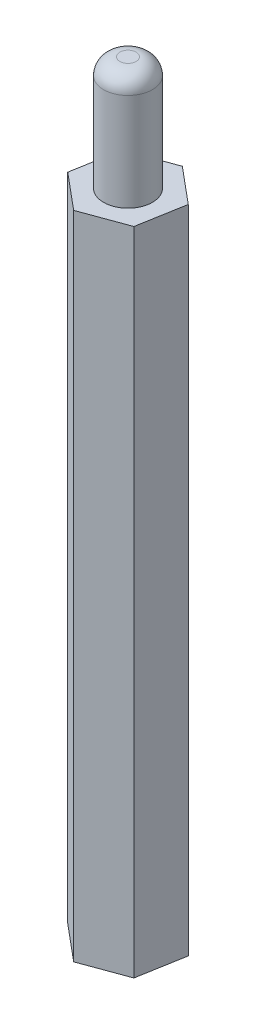
ISO-10303-21;
HEADER;
FILE_DESCRIPTION(('STEP AP214'),'2;1');
FILE_NAME('part.step','',(''),(''),'','','');
FILE_SCHEMA(('AUTOMOTIVE_DESIGN { 1 0 10303 214 1 1 1 1 }'));
ENDSEC;
DATA;
#1=APPLICATION_CONTEXT('core data for automotive mechanical design processes');
#2=APPLICATION_PROTOCOL_DEFINITION('international standard','automotive_design',2000,#1);
#3=PRODUCT_CONTEXT('',#1,'mechanical');
#4=PRODUCT('Part','Part','',(#3));
#5=PRODUCT_RELATED_PRODUCT_CATEGORY('part','',(#4));
#6=PRODUCT_DEFINITION_FORMATION('','',#4);
#7=PRODUCT_DEFINITION_CONTEXT('part definition',#1,'design');
#8=PRODUCT_DEFINITION('design','',#6,#7);
#9=PRODUCT_DEFINITION_SHAPE('','',#8);
#10=(LENGTH_UNIT() NAMED_UNIT(*) SI_UNIT(.MILLI.,.METRE.));
#11=(NAMED_UNIT(*) PLANE_ANGLE_UNIT() SI_UNIT($,.RADIAN.));
#12=(NAMED_UNIT(*) SI_UNIT($,.STERADIAN.) SOLID_ANGLE_UNIT());
#13=UNCERTAINTY_MEASURE_WITH_UNIT(LENGTH_MEASURE(1.E-05),#10,'distance_accuracy_value','');
#14=(GEOMETRIC_REPRESENTATION_CONTEXT(3) GLOBAL_UNCERTAINTY_ASSIGNED_CONTEXT((#13)) GLOBAL_UNIT_ASSIGNED_CONTEXT((#10,
#11,#12)) REPRESENTATION_CONTEXT('',''));
#15=CARTESIAN_POINT('',(0.,0.,0.));
#16=DIRECTION('',(0.,0.,1.));
#17=DIRECTION('',(1.,0.,0.));
#18=AXIS2_PLACEMENT_3D('',#15,#16,#17);
#19=CARTESIAN_POINT('',(-0.495994709202007,40.,2.84382182665809));
#20=DIRECTION('',(-0.343765976383913,0.,-0.939055351659749));
#21=DIRECTION('',(-0.939055351659749,0.,0.343765976383913));
#22=AXIS2_PLACEMENT_3D('',#19,#20,#21);
#23=PLANE('',#22);
#24=DIRECTION('',(0.939055351659749,0.,-0.343765976383913));
#25=VECTOR('',#24,1.);
#26=CARTESIAN_POINT('',(-0.495994709202007,0.,2.84382182665809));
#27=LINE('',#26,#25);
#28=CARTESIAN_POINT('',(-0.495994709202007,0.,2.84382182665809));
#29=VERTEX_POINT('',#28);
#30=CARTESIAN_POINT('',(2.21482459112157,0.,1.85145493164066));
#31=VERTEX_POINT('',#30);
#32=EDGE_CURVE('E134',#29,#31,#27,.T.);
#33=ORIENTED_EDGE('',*,*,#32,.T.);
#34=DIRECTION('',(0.,-1.,0.));
#35=VECTOR('',#34,1.);
#36=CARTESIAN_POINT('',(2.21482459112157,40.,1.85145493164066));
#37=LINE('',#36,#35);
#38=CARTESIAN_POINT('',(2.21482459112157,40.,1.85145493164066));
#39=VERTEX_POINT('',#38);
#40=EDGE_CURVE('E162',#39,#31,#37,.T.);
#41=ORIENTED_EDGE('',*,*,#40,.F.);
#42=DIRECTION('',(0.939055351659749,0.,-0.343765976383913));
#43=VECTOR('',#42,1.);
#44=CARTESIAN_POINT('',(-0.495994709202007,40.,2.84382182665809));
#45=LINE('',#44,#43);
#46=CARTESIAN_POINT('',(-0.495994709202007,40.,2.84382182665809));
#47=VERTEX_POINT('',#46);
#48=EDGE_CURVE('E151',#47,#39,#45,.T.);
#49=ORIENTED_EDGE('',*,*,#48,.F.);
#50=DIRECTION('',(0.,-1.,0.));
#51=VECTOR('',#50,1.);
#52=CARTESIAN_POINT('',(-0.495994709202007,40.,2.84382182665809));
#53=LINE('',#52,#51);
#54=EDGE_CURVE('E130',#47,#29,#53,.T.);
#55=ORIENTED_EDGE('',*,*,#54,.T.);
#56=EDGE_LOOP('',(#33,#41,#49,#55));
#57=FACE_BOUND('',#56,.T.);
#58=ADVANCED_FACE('F43',(#57),#23,.F.);
#59=CARTESIAN_POINT('',(2.21482459112157,40.,1.85145493164066));
#60=DIRECTION('',(-0.985128778289029,0.,-0.171817607324645));
#61=DIRECTION('',(-0.171817607324645,0.,0.985128778289029));
#62=AXIS2_PLACEMENT_3D('',#59,#60,#61);
#63=PLANE('',#62);
#64=DIRECTION('',(0.171817607324645,0.,-0.985128778289029));
#65=VECTOR('',#64,1.);
#66=CARTESIAN_POINT('',(2.21482459112157,0.,1.85145493164066));
#67=LINE('',#66,#65);
#68=CARTESIAN_POINT('',(2.71081930032357,0.,-0.992366895017432));
#69=VERTEX_POINT('',#68);
#70=EDGE_CURVE('E138',#31,#69,#67,.T.);
#71=ORIENTED_EDGE('',*,*,#70,.T.);
#72=DIRECTION('',(0.,-1.,0.));
#73=VECTOR('',#72,1.);
#74=CARTESIAN_POINT('',(2.71081930032357,40.,-0.992366895017432));
#75=LINE('',#74,#73);
#76=CARTESIAN_POINT('',(2.71081930032357,40.,-0.992366895017432));
#77=VERTEX_POINT('',#76);
#78=EDGE_CURVE('E158',#77,#69,#75,.T.);
#79=ORIENTED_EDGE('',*,*,#78,.F.);
#80=DIRECTION('',(0.171817607324645,0.,-0.985128778289029));
#81=VECTOR('',#80,1.);
#82=CARTESIAN_POINT('',(2.21482459112157,40.,1.85145493164066));
#83=LINE('',#82,#81);
#84=EDGE_CURVE('E99',#39,#77,#83,.T.);
#85=ORIENTED_EDGE('',*,*,#84,.F.);
#86=ORIENTED_EDGE('',*,*,#40,.T.);
#87=EDGE_LOOP('',(#71,#79,#85,#86));
#88=FACE_BOUND('',#87,.T.);
#89=ADVANCED_FACE('F211',(#88),#63,.F.);
#90=CARTESIAN_POINT('',(2.71081930032357,40.,-0.992366895017432));
#91=DIRECTION('',(-0.641362801905116,0.,0.767237744335104));
#92=DIRECTION('',(0.767237744335104,0.,0.641362801905116));
#93=AXIS2_PLACEMENT_3D('',#90,#91,#92);
#94=PLANE('',#93);
#95=DIRECTION('',(-0.767237744335104,0.,-0.641362801905116));
#96=VECTOR('',#95,1.);
#97=CARTESIAN_POINT('',(2.71081930032357,0.,-0.992366895017432));
#98=LINE('',#97,#96);
#99=CARTESIAN_POINT('',(0.495994709202006,0.,-2.84382182665809));
#100=VERTEX_POINT('',#99);
#101=EDGE_CURVE('E142',#69,#100,#98,.T.);
#102=ORIENTED_EDGE('',*,*,#101,.T.);
#103=DIRECTION('',(0.,-1.,0.));
#104=VECTOR('',#103,1.);
#105=CARTESIAN_POINT('',(0.495994709202006,40.,-2.84382182665809));
#106=LINE('',#105,#104);
#107=CARTESIAN_POINT('',(0.495994709202006,40.,-2.84382182665809));
#108=VERTEX_POINT('',#107);
#109=EDGE_CURVE('E123',#108,#100,#106,.T.);
#110=ORIENTED_EDGE('',*,*,#109,.F.);
#111=DIRECTION('',(-0.767237744335104,0.,-0.641362801905116));
#112=VECTOR('',#111,1.);
#113=CARTESIAN_POINT('',(2.71081930032357,40.,-0.992366895017432));
#114=LINE('',#113,#112);
#115=EDGE_CURVE('E112',#77,#108,#114,.T.);
#116=ORIENTED_EDGE('',*,*,#115,.F.);
#117=ORIENTED_EDGE('',*,*,#78,.T.);
#118=EDGE_LOOP('',(#102,#110,#116,#117));
#119=FACE_BOUND('',#118,.T.);
#120=ADVANCED_FACE('F215',(#119),#94,.F.);
#121=CARTESIAN_POINT('',(0.495994709202006,40.,-2.84382182665809));
#122=DIRECTION('',(0.343765976383912,0.,0.939055351659749));
#123=DIRECTION('',(0.939055351659749,0.,-0.343765976383912));
#124=AXIS2_PLACEMENT_3D('',#121,#122,#123);
#125=PLANE('',#124);
#126=DIRECTION('',(-0.939055351659749,0.,0.343765976383912));
#127=VECTOR('',#126,1.);
#128=CARTESIAN_POINT('',(0.495994709202006,0.,-2.84382182665809));
#129=LINE('',#128,#127);
#130=CARTESIAN_POINT('',(-2.21482459112157,0.,-1.85145493164066));
#131=VERTEX_POINT('',#130);
#132=EDGE_CURVE('E121',#100,#131,#129,.T.);
#133=ORIENTED_EDGE('',*,*,#132,.T.);
#134=DIRECTION('',(0.,-1.,0.));
#135=VECTOR('',#134,1.);
#136=CARTESIAN_POINT('',(-2.21482459112157,40.,-1.85145493164066));
#137=LINE('',#136,#135);
#138=CARTESIAN_POINT('',(-2.21482459112157,40.,-1.85145493164066));
#139=VERTEX_POINT('',#138);
#140=EDGE_CURVE('E118',#139,#131,#137,.T.);
#141=ORIENTED_EDGE('',*,*,#140,.F.);
#142=DIRECTION('',(-0.939055351659749,0.,0.343765976383912));
#143=VECTOR('',#142,1.);
#144=CARTESIAN_POINT('',(0.495994709202006,40.,-2.84382182665809));
#145=LINE('',#144,#143);
#146=EDGE_CURVE('E106',#108,#139,#145,.T.);
#147=ORIENTED_EDGE('',*,*,#146,.F.);
#148=ORIENTED_EDGE('',*,*,#109,.T.);
#149=EDGE_LOOP('',(#133,#141,#147,#148));
#150=FACE_BOUND('',#149,.T.);
#151=ADVANCED_FACE('F119',(#150),#125,.F.);
#152=CARTESIAN_POINT('',(-2.21482459112157,40.,-1.85145493164066));
#153=DIRECTION('',(0.985128778289029,0.,0.171817607324645));
#154=DIRECTION('',(0.171817607324645,0.,-0.985128778289029));
#155=AXIS2_PLACEMENT_3D('',#152,#153,#154);
#156=PLANE('',#155);
#157=DIRECTION('',(-0.171817607324645,0.,0.985128778289029));
#158=VECTOR('',#157,1.);
#159=CARTESIAN_POINT('',(-2.21482459112157,0.,-1.85145493164066));
#160=LINE('',#159,#158);
#161=CARTESIAN_POINT('',(-2.71081930032357,0.,0.992366895017432));
#162=VERTEX_POINT('',#161);
#163=EDGE_CURVE('E84',#131,#162,#160,.T.);
#164=ORIENTED_EDGE('',*,*,#163,.T.);
#165=DIRECTION('',(0.,-1.,0.));
#166=VECTOR('',#165,1.);
#167=CARTESIAN_POINT('',(-2.71081930032357,40.,0.992366895017432));
#168=LINE('',#167,#166);
#169=CARTESIAN_POINT('',(-2.71081930032357,40.,0.992366895017432));
#170=VERTEX_POINT('',#169);
#171=EDGE_CURVE('E124',#170,#162,#168,.T.);
#172=ORIENTED_EDGE('',*,*,#171,.F.);
#173=DIRECTION('',(-0.171817607324645,0.,0.985128778289029));
#174=VECTOR('',#173,1.);
#175=CARTESIAN_POINT('',(-2.21482459112157,40.,-1.85145493164066));
#176=LINE('',#175,#174);
#177=EDGE_CURVE('E110',#139,#170,#176,.T.);
#178=ORIENTED_EDGE('',*,*,#177,.F.);
#179=ORIENTED_EDGE('',*,*,#140,.T.);
#180=EDGE_LOOP('',(#164,#172,#178,#179));
#181=FACE_BOUND('',#180,.T.);
#182=ADVANCED_FACE('F126',(#181),#156,.F.);
#183=CARTESIAN_POINT('',(-2.71081930032357,40.,0.992366895017432));
#184=DIRECTION('',(0.641362801905116,0.,-0.767237744335104));
#185=DIRECTION('',(-0.767237744335104,0.,-0.641362801905116));
#186=AXIS2_PLACEMENT_3D('',#183,#184,#185);
#187=PLANE('',#186);
#188=DIRECTION('',(0.767237744335104,0.,0.641362801905116));
#189=VECTOR('',#188,1.);
#190=CARTESIAN_POINT('',(-2.71081930032357,0.,0.992366895017432));
#191=LINE('',#190,#189);
#192=EDGE_CURVE('E90',#162,#29,#191,.T.);
#193=ORIENTED_EDGE('',*,*,#192,.T.);
#194=ORIENTED_EDGE('',*,*,#54,.F.);
#195=DIRECTION('',(0.767237744335104,0.,0.641362801905116));
#196=VECTOR('',#195,1.);
#197=CARTESIAN_POINT('',(-2.71081930032357,40.,0.992366895017432));
#198=LINE('',#197,#196);
#199=EDGE_CURVE('E61',#170,#47,#198,.T.);
#200=ORIENTED_EDGE('',*,*,#199,.F.);
#201=ORIENTED_EDGE('',*,*,#171,.T.);
#202=EDGE_LOOP('',(#193,#194,#200,#201));
#203=FACE_BOUND('',#202,.T.);
#204=ADVANCED_FACE('F200',(#203),#187,.F.);
#205=CARTESIAN_POINT('',(0.,40.,0.));
#206=DIRECTION('',(0.,1.,0.));
#207=DIRECTION('',(0.,0.,1.));
#208=AXIS2_PLACEMENT_3D('',#205,#206,#207);
#209=PLANE('',#208);
#210=CARTESIAN_POINT('',(0.,40.,0.));
#211=DIRECTION('',(0.,1.,0.));
#212=DIRECTION('',(0.,0.,1.));
#213=AXIS2_PLACEMENT_3D('',#210,#211,#212);
#214=CIRCLE('',#213,1.5);
#215=CARTESIAN_POINT('',(0.,40.,1.5));
#216=VERTEX_POINT('',#215);
#217=EDGE_CURVE('E164',#216,#216,#214,.T.);
#218=ORIENTED_EDGE('',*,*,#217,.F.);
#219=EDGE_LOOP('',(#218));
#220=FACE_BOUND('',#219,.T.);
#221=ORIENTED_EDGE('',*,*,#48,.T.);
#222=ORIENTED_EDGE('',*,*,#84,.T.);
#223=ORIENTED_EDGE('',*,*,#115,.T.);
#224=ORIENTED_EDGE('',*,*,#146,.T.);
#225=ORIENTED_EDGE('',*,*,#177,.T.);
#226=ORIENTED_EDGE('',*,*,#199,.T.);
#227=EDGE_LOOP('',(#221,#222,#223,#224,#225,#226));
#228=FACE_BOUND('',#227,.T.);
#229=ADVANCED_FACE('F108',(#220,#228),#209,.T.);
#230=CARTESIAN_POINT('',(0.,0.,0.));
#231=DIRECTION('',(0.,1.,0.));
#232=DIRECTION('',(0.,0.,1.));
#233=AXIS2_PLACEMENT_3D('',#230,#231,#232);
#234=PLANE('',#233);
#235=CARTESIAN_POINT('',(0.,0.,0.));
#236=DIRECTION('',(0.,-1.,0.));
#237=DIRECTION('',(0.,0.,-1.));
#238=AXIS2_PLACEMENT_3D('',#235,#236,#237);
#239=CIRCLE('',#238,1.5);
#240=CARTESIAN_POINT('',(0.,0.,-1.5));
#241=VERTEX_POINT('',#240);
#242=EDGE_CURVE('E176',#241,#241,#239,.T.);
#243=ORIENTED_EDGE('',*,*,#242,.F.);
#244=EDGE_LOOP('',(#243));
#245=FACE_BOUND('',#244,.T.);
#246=ORIENTED_EDGE('',*,*,#32,.F.);
#247=ORIENTED_EDGE('',*,*,#192,.F.);
#248=ORIENTED_EDGE('',*,*,#163,.F.);
#249=ORIENTED_EDGE('',*,*,#132,.F.);
#250=ORIENTED_EDGE('',*,*,#101,.F.);
#251=ORIENTED_EDGE('',*,*,#70,.F.);
#252=EDGE_LOOP('',(#246,#247,#248,#249,#250,#251));
#253=FACE_BOUND('',#252,.T.);
#254=ADVANCED_FACE('F190',(#245,#253),#234,.F.);
#255=CARTESIAN_POINT('',(0.,47.,0.));
#256=DIRECTION('',(0.,-1.,0.));
#257=DIRECTION('',(0.,0.,-1.));
#258=AXIS2_PLACEMENT_3D('',#255,#256,#257);
#259=CYLINDRICAL_SURFACE('',#258,1.5);
#260=CARTESIAN_POINT('',(0.,46.,0.));
#261=DIRECTION('',(0.,1.,0.));
#262=DIRECTION('',(0.,0.,1.));
#263=AXIS2_PLACEMENT_3D('',#260,#261,#262);
#264=CIRCLE('',#263,1.5);
#265=CARTESIAN_POINT('',(0.,46.,1.5));
#266=VERTEX_POINT('',#265);
#267=EDGE_CURVE('E11',#266,#266,#264,.F.);
#268=ORIENTED_EDGE('',*,*,#267,.T.);
#269=EDGE_LOOP('',(#268));
#270=FACE_BOUND('',#269,.T.);
#271=ORIENTED_EDGE('',*,*,#217,.T.);
#272=EDGE_LOOP('',(#271));
#273=FACE_BOUND('',#272,.T.);
#274=ADVANCED_FACE('F193',(#270,#273),#259,.T.);
#275=CARTESIAN_POINT('',(0.,47.,0.));
#276=DIRECTION('',(0.,1.,0.));
#277=DIRECTION('',(0.,0.,1.));
#278=AXIS2_PLACEMENT_3D('',#275,#276,#277);
#279=PLANE('',#278);
#280=CARTESIAN_POINT('',(0.,47.,0.));
#281=DIRECTION('',(0.,1.,0.));
#282=DIRECTION('',(0.,0.,1.));
#283=AXIS2_PLACEMENT_3D('',#280,#281,#282);
#284=CIRCLE('',#283,0.5);
#285=CARTESIAN_POINT('',(0.,47.,0.5));
#286=VERTEX_POINT('',#285);
#287=EDGE_CURVE('E53',#286,#286,#284,.T.);
#288=ORIENTED_EDGE('',*,*,#287,.T.);
#289=EDGE_LOOP('',(#288));
#290=FACE_BOUND('',#289,.T.);
#291=ADVANCED_FACE('F262',(#290),#279,.T.);
#292=CARTESIAN_POINT('',(0.,7.,0.));
#293=DIRECTION('',(0.,-1.,0.));
#294=DIRECTION('',(0.,0.,-1.));
#295=AXIS2_PLACEMENT_3D('',#292,#293,#294);
#296=CYLINDRICAL_SURFACE('',#295,1.5);
#297=CARTESIAN_POINT('',(0.,7.,0.));
#298=DIRECTION('',(0.,-1.,0.));
#299=DIRECTION('',(0.,0.,-1.));
#300=AXIS2_PLACEMENT_3D('',#297,#298,#299);
#301=CIRCLE('',#300,1.5);
#302=CARTESIAN_POINT('',(0.,7.,-1.5));
#303=VERTEX_POINT('',#302);
#304=EDGE_CURVE('E139',#303,#303,#301,.T.);
#305=ORIENTED_EDGE('',*,*,#304,.F.);
#306=EDGE_LOOP('',(#305));
#307=FACE_BOUND('',#306,.T.);
#308=ORIENTED_EDGE('',*,*,#242,.T.);
#309=EDGE_LOOP('',(#308));
#310=FACE_BOUND('',#309,.T.);
#311=ADVANCED_FACE('F188',(#307,#310),#296,.F.);
#312=CARTESIAN_POINT('',(0.,7.,0.));
#313=DIRECTION('',(0.,-1.,0.));
#314=DIRECTION('',(0.,0.,-1.));
#315=AXIS2_PLACEMENT_3D('',#312,#313,#314);
#316=PLANE('',#315);
#317=ORIENTED_EDGE('',*,*,#304,.T.);
#318=EDGE_LOOP('',(#317));
#319=FACE_BOUND('',#318,.T.);
#320=ADVANCED_FACE('F261',(#319),#316,.T.);
#321=CARTESIAN_POINT('',(0.,46.,0.));
#322=DIRECTION('',(0.,1.,0.));
#323=DIRECTION('',(0.,0.,1.));
#324=AXIS2_PLACEMENT_3D('',#321,#322,#323);
#325=DEGENERATE_TOROIDAL_SURFACE('',#324,0.5,1.,.T.);
#326=ORIENTED_EDGE('',*,*,#267,.F.);
#327=EDGE_LOOP('',(#326));
#328=FACE_BOUND('',#327,.T.);
#329=ORIENTED_EDGE('',*,*,#287,.F.);
#330=EDGE_LOOP('',(#329));
#331=FACE_BOUND('',#330,.T.);
#332=ADVANCED_FACE('F45',(#328,#331),#325,.T.);
#333=CLOSED_SHELL('',(#58,#89,#120,#151,#182,#204,#229,#254,#274,#291,#311,#320,#332));
#334=MANIFOLD_SOLID_BREP('B2',#333);
#335=ADVANCED_BREP_SHAPE_REPRESENTATION('',(#18,#334),#14);
#336=SHAPE_DEFINITION_REPRESENTATION(#9,#335);
ENDSEC;
END-ISO-10303-21;
